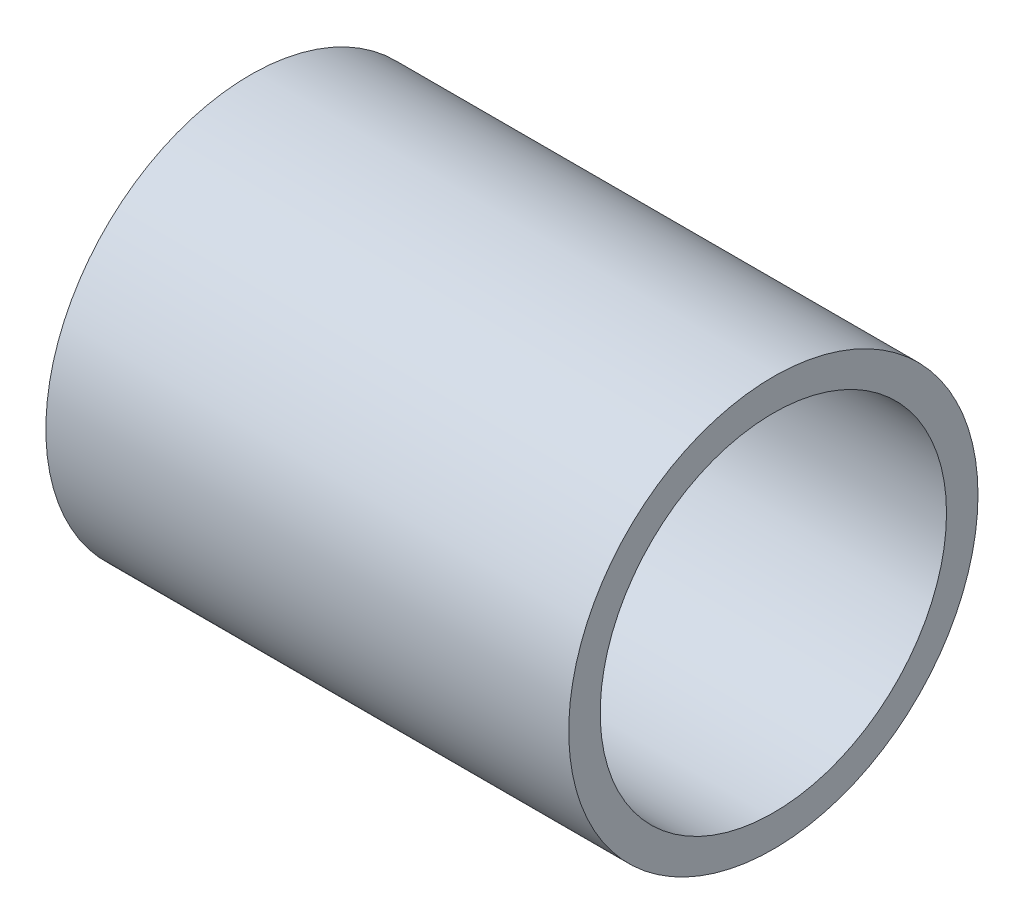
ISO-10303-21;
HEADER;
FILE_DESCRIPTION(('STEP AP214'),'2;1');
FILE_NAME('part.step','',(''),(''),'','','');
FILE_SCHEMA(('AUTOMOTIVE_DESIGN { 1 0 10303 214 1 1 1 1 }'));
ENDSEC;
DATA;
#1=APPLICATION_CONTEXT('core data for automotive mechanical design processes');
#2=APPLICATION_PROTOCOL_DEFINITION('international standard','automotive_design',2000,#1);
#3=PRODUCT_CONTEXT('',#1,'mechanical');
#4=PRODUCT('Part','Part','',(#3));
#5=PRODUCT_RELATED_PRODUCT_CATEGORY('part','',(#4));
#6=PRODUCT_DEFINITION_FORMATION('','',#4);
#7=PRODUCT_DEFINITION_CONTEXT('part definition',#1,'design');
#8=PRODUCT_DEFINITION('design','',#6,#7);
#9=PRODUCT_DEFINITION_SHAPE('','',#8);
#10=(LENGTH_UNIT() NAMED_UNIT(*) SI_UNIT(.MILLI.,.METRE.));
#11=(NAMED_UNIT(*) PLANE_ANGLE_UNIT() SI_UNIT($,.RADIAN.));
#12=(NAMED_UNIT(*) SI_UNIT($,.STERADIAN.) SOLID_ANGLE_UNIT());
#13=UNCERTAINTY_MEASURE_WITH_UNIT(LENGTH_MEASURE(1.E-05),#10,'distance_accuracy_value','');
#14=(GEOMETRIC_REPRESENTATION_CONTEXT(3) GLOBAL_UNCERTAINTY_ASSIGNED_CONTEXT((#13)) GLOBAL_UNIT_ASSIGNED_CONTEXT((#10,
#11,#12)) REPRESENTATION_CONTEXT('',''));
#15=CARTESIAN_POINT('',(0.,0.,0.));
#16=DIRECTION('',(0.,0.,1.));
#17=DIRECTION('',(1.,0.,0.));
#18=AXIS2_PLACEMENT_3D('',#15,#16,#17);
#19=CARTESIAN_POINT('',(83.04,0.,0.));
#20=DIRECTION('',(1.,0.,0.));
#21=DIRECTION('',(0.,0.,-1.));
#22=AXIS2_PLACEMENT_3D('',#19,#20,#21);
#23=PLANE('',#22);
#24=CARTESIAN_POINT('',(83.04,0.,0.));
#25=DIRECTION('',(1.,0.,0.));
#26=DIRECTION('',(0.,0.,-1.));
#27=AXIS2_PLACEMENT_3D('',#24,#25,#26);
#28=CIRCLE('',#27,32.5);
#29=CARTESIAN_POINT('',(83.04,0.,-32.5));
#30=VERTEX_POINT('',#29);
#31=EDGE_CURVE('E10',#30,#30,#28,.T.);
#32=ORIENTED_EDGE('',*,*,#31,.T.);
#33=EDGE_LOOP('',(#32));
#34=FACE_BOUND('',#33,.T.);
#35=CARTESIAN_POINT('',(83.04,0.,0.));
#36=DIRECTION('',(1.,0.,0.));
#37=DIRECTION('',(0.,0.,-1.));
#38=AXIS2_PLACEMENT_3D('',#35,#36,#37);
#39=CIRCLE('',#38,27.5);
#40=CARTESIAN_POINT('',(83.04,0.,-27.5));
#41=VERTEX_POINT('',#40);
#42=EDGE_CURVE('E54',#41,#41,#39,.T.);
#43=ORIENTED_EDGE('',*,*,#42,.F.);
#44=EDGE_LOOP('',(#43));
#45=FACE_BOUND('',#44,.T.);
#46=ADVANCED_FACE('F41',(#34,#45),#23,.T.);
#47=CARTESIAN_POINT('',(0.,0.,0.));
#48=DIRECTION('',(1.,0.,0.));
#49=DIRECTION('',(0.,0.,-1.));
#50=AXIS2_PLACEMENT_3D('',#47,#48,#49);
#51=PLANE('',#50);
#52=CARTESIAN_POINT('',(0.,0.,0.));
#53=DIRECTION('',(1.,0.,0.));
#54=DIRECTION('',(0.,0.,-1.));
#55=AXIS2_PLACEMENT_3D('',#52,#53,#54);
#56=CIRCLE('',#55,32.5);
#57=CARTESIAN_POINT('',(0.,0.,-32.5));
#58=VERTEX_POINT('',#57);
#59=EDGE_CURVE('E45',#58,#58,#56,.T.);
#60=ORIENTED_EDGE('',*,*,#59,.F.);
#61=EDGE_LOOP('',(#60));
#62=FACE_BOUND('',#61,.T.);
#63=CARTESIAN_POINT('',(0.,0.,0.));
#64=DIRECTION('',(1.,0.,0.));
#65=DIRECTION('',(0.,0.,-1.));
#66=AXIS2_PLACEMENT_3D('',#63,#64,#65);
#67=CIRCLE('',#66,27.5);
#68=CARTESIAN_POINT('',(0.,0.,-27.5));
#69=VERTEX_POINT('',#68);
#70=EDGE_CURVE('E56',#69,#69,#67,.T.);
#71=ORIENTED_EDGE('',*,*,#70,.T.);
#72=EDGE_LOOP('',(#71));
#73=FACE_BOUND('',#72,.T.);
#74=ADVANCED_FACE('F68',(#62,#73),#51,.F.);
#75=CARTESIAN_POINT('',(83.04,0.,0.));
#76=DIRECTION('',(-1.,0.,0.));
#77=DIRECTION('',(0.,0.,1.));
#78=AXIS2_PLACEMENT_3D('',#75,#76,#77);
#79=CYLINDRICAL_SURFACE('',#78,32.5);
#80=ORIENTED_EDGE('',*,*,#31,.F.);
#81=EDGE_LOOP('',(#80));
#82=FACE_BOUND('',#81,.T.);
#83=ORIENTED_EDGE('',*,*,#59,.T.);
#84=EDGE_LOOP('',(#83));
#85=FACE_BOUND('',#84,.T.);
#86=ADVANCED_FACE('F43',(#82,#85),#79,.T.);
#87=CARTESIAN_POINT('',(83.04,0.,0.));
#88=DIRECTION('',(-1.,0.,0.));
#89=DIRECTION('',(0.,0.,1.));
#90=AXIS2_PLACEMENT_3D('',#87,#88,#89);
#91=CYLINDRICAL_SURFACE('',#90,27.5);
#92=ORIENTED_EDGE('',*,*,#42,.T.);
#93=EDGE_LOOP('',(#92));
#94=FACE_BOUND('',#93,.T.);
#95=ORIENTED_EDGE('',*,*,#70,.F.);
#96=EDGE_LOOP('',(#95));
#97=FACE_BOUND('',#96,.T.);
#98=ADVANCED_FACE('F64',(#94,#97),#91,.F.);
#99=CLOSED_SHELL('',(#46,#74,#86,#98));
#100=MANIFOLD_SOLID_BREP('B2',#99);
#101=ADVANCED_BREP_SHAPE_REPRESENTATION('',(#18,#100),#14);
#102=SHAPE_DEFINITION_REPRESENTATION(#9,#101);
ENDSEC;
END-ISO-10303-21;
